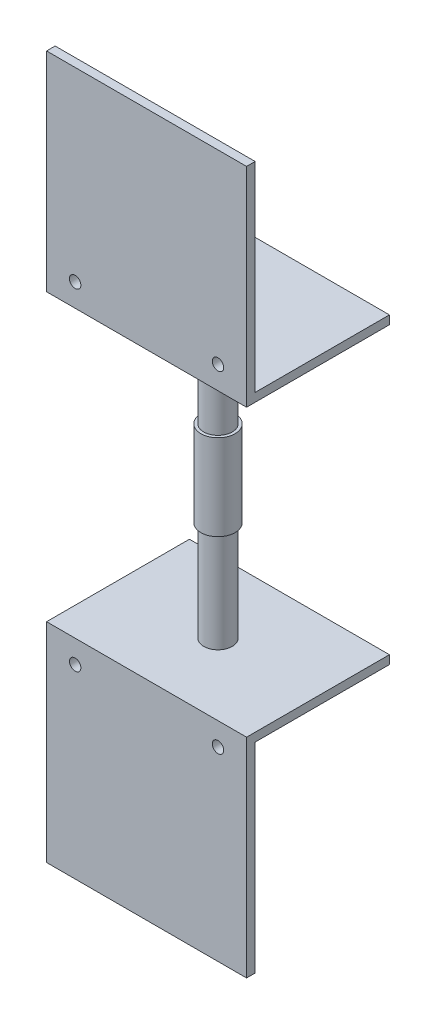
ISO-10303-21;
HEADER;
FILE_DESCRIPTION(('STEP AP214'),'2;1');
FILE_NAME('part.step','',(''),(''),'','','');
FILE_SCHEMA(('AUTOMOTIVE_DESIGN { 1 0 10303 214 1 1 1 1 }'));
ENDSEC;
DATA;
#1=APPLICATION_CONTEXT('core data for automotive mechanical design processes');
#2=APPLICATION_PROTOCOL_DEFINITION('international standard','automotive_design',2000,#1);
#3=PRODUCT_CONTEXT('',#1,'mechanical');
#4=PRODUCT('Part','Part','',(#3));
#5=PRODUCT_RELATED_PRODUCT_CATEGORY('part','',(#4));
#6=PRODUCT_DEFINITION_FORMATION('','',#4);
#7=PRODUCT_DEFINITION_CONTEXT('part definition',#1,'design');
#8=PRODUCT_DEFINITION('design','',#6,#7);
#9=PRODUCT_DEFINITION_SHAPE('','',#8);
#10=(LENGTH_UNIT() NAMED_UNIT(*) SI_UNIT(.MILLI.,.METRE.));
#11=(NAMED_UNIT(*) PLANE_ANGLE_UNIT() SI_UNIT($,.RADIAN.));
#12=(NAMED_UNIT(*) SI_UNIT($,.STERADIAN.) SOLID_ANGLE_UNIT());
#13=UNCERTAINTY_MEASURE_WITH_UNIT(LENGTH_MEASURE(1.E-05),#10,'distance_accuracy_value','');
#14=(GEOMETRIC_REPRESENTATION_CONTEXT(3) GLOBAL_UNCERTAINTY_ASSIGNED_CONTEXT((#13)) GLOBAL_UNIT_ASSIGNED_CONTEXT((#10,
#11,#12)) REPRESENTATION_CONTEXT('',''));
#15=CARTESIAN_POINT('',(0.,0.,0.));
#16=DIRECTION('',(0.,0.,1.));
#17=DIRECTION('',(1.,0.,0.));
#18=AXIS2_PLACEMENT_3D('',#15,#16,#17);
#19=CARTESIAN_POINT('',(0.,-103.,0.));
#20=DIRECTION('',(0.,1.,0.));
#21=DIRECTION('',(0.,0.,1.));
#22=AXIS2_PLACEMENT_3D('',#19,#20,#21);
#23=PLANE('',#22);
#24=DIRECTION('',(1.,0.,0.));
#25=VECTOR('',#24,1.);
#26=CARTESIAN_POINT('',(-35.,-103.,22.));
#27=LINE('',#26,#25);
#28=CARTESIAN_POINT('',(-35.,-103.,22.));
#29=VERTEX_POINT('',#28);
#30=CARTESIAN_POINT('',(35.,-103.,22.));
#31=VERTEX_POINT('',#30);
#32=EDGE_CURVE('E55',#29,#31,#27,.T.);
#33=ORIENTED_EDGE('',*,*,#32,.F.);
#34=DIRECTION('',(0.,0.,-1.));
#35=VECTOR('',#34,1.);
#36=CARTESIAN_POINT('',(-35.,-103.,-25.));
#37=LINE('',#36,#35);
#38=CARTESIAN_POINT('',(-35.,-103.,-25.));
#39=VERTEX_POINT('',#38);
#40=EDGE_CURVE('E154',#29,#39,#37,.T.);
#41=ORIENTED_EDGE('',*,*,#40,.T.);
#42=DIRECTION('',(1.,0.,0.));
#43=VECTOR('',#42,1.);
#44=CARTESIAN_POINT('',(-35.,-103.,-25.));
#45=LINE('',#44,#43);
#46=CARTESIAN_POINT('',(35.,-103.,-25.));
#47=VERTEX_POINT('',#46);
#48=EDGE_CURVE('E172',#39,#47,#45,.T.);
#49=ORIENTED_EDGE('',*,*,#48,.T.);
#50=DIRECTION('',(0.,0.,1.));
#51=VECTOR('',#50,1.);
#52=CARTESIAN_POINT('',(35.,-103.,-25.));
#53=LINE('',#52,#51);
#54=EDGE_CURVE('E166',#47,#31,#53,.T.);
#55=ORIENTED_EDGE('',*,*,#54,.T.);
#56=EDGE_LOOP('',(#33,#41,#49,#55));
#57=FACE_BOUND('',#56,.T.);
#58=ADVANCED_FACE('F39',(#57),#23,.F.);
#59=CARTESIAN_POINT('',(-35.,3.,25.));
#60=DIRECTION('',(1.,0.,0.));
#61=DIRECTION('',(0.,0.,-1.));
#62=AXIS2_PLACEMENT_3D('',#59,#60,#61);
#63=PLANE('',#62);
#64=DIRECTION('',(0.,0.,1.));
#65=VECTOR('',#64,1.);
#66=CARTESIAN_POINT('',(-35.,0.,25.));
#67=LINE('',#66,#65);
#68=CARTESIAN_POINT('',(-35.,0.,-25.));
#69=VERTEX_POINT('',#68);
#70=CARTESIAN_POINT('',(-35.,0.,25.));
#71=VERTEX_POINT('',#70);
#72=EDGE_CURVE('E257',#69,#71,#67,.T.);
#73=ORIENTED_EDGE('',*,*,#72,.T.);
#74=DIRECTION('',(0.,-1.,0.));
#75=VECTOR('',#74,1.);
#76=CARTESIAN_POINT('',(-35.,3.,25.));
#77=LINE('',#76,#75);
#78=CARTESIAN_POINT('',(-35.,73.,25.));
#79=VERTEX_POINT('',#78);
#80=EDGE_CURVE('E48',#79,#71,#77,.T.);
#81=ORIENTED_EDGE('',*,*,#80,.F.);
#82=DIRECTION('',(0.,0.,1.));
#83=VECTOR('',#82,1.);
#84=CARTESIAN_POINT('',(-35.,73.,25.));
#85=LINE('',#84,#83);
#86=CARTESIAN_POINT('',(-35.,73.,22.));
#87=VERTEX_POINT('',#86);
#88=EDGE_CURVE('E233',#87,#79,#85,.T.);
#89=ORIENTED_EDGE('',*,*,#88,.F.);
#90=DIRECTION('',(0.,-1.,0.));
#91=VECTOR('',#90,1.);
#92=CARTESIAN_POINT('',(-35.,73.,22.));
#93=LINE('',#92,#91);
#94=CARTESIAN_POINT('',(-35.,3.,22.));
#95=VERTEX_POINT('',#94);
#96=EDGE_CURVE('E247',#87,#95,#93,.T.);
#97=ORIENTED_EDGE('',*,*,#96,.T.);
#98=DIRECTION('',(0.,0.,1.));
#99=VECTOR('',#98,1.);
#100=CARTESIAN_POINT('',(-35.,3.,25.));
#101=LINE('',#100,#99);
#102=CARTESIAN_POINT('',(-35.,3.,-25.));
#103=VERTEX_POINT('',#102);
#104=EDGE_CURVE('E258',#103,#95,#101,.T.);
#105=ORIENTED_EDGE('',*,*,#104,.F.);
#106=DIRECTION('',(0.,-1.,0.));
#107=VECTOR('',#106,1.);
#108=CARTESIAN_POINT('',(-35.,3.,-25.));
#109=LINE('',#108,#107);
#110=EDGE_CURVE('E268',#103,#69,#109,.T.);
#111=ORIENTED_EDGE('',*,*,#110,.T.);
#112=EDGE_LOOP('',(#73,#81,#89,#97,#105,#111));
#113=FACE_BOUND('',#112,.T.);
#114=ADVANCED_FACE('F41',(#113),#63,.F.);
#115=CARTESIAN_POINT('',(35.,3.,25.));
#116=DIRECTION('',(0.,0.,-1.));
#117=DIRECTION('',(-1.,0.,0.));
#118=AXIS2_PLACEMENT_3D('',#115,#116,#117);
#119=PLANE('',#118);
#120=CARTESIAN_POINT('',(25.,8.,25.));
#121=DIRECTION('',(0.,0.,-1.));
#122=DIRECTION('',(-1.,0.,0.));
#123=AXIS2_PLACEMENT_3D('',#120,#121,#122);
#124=CIRCLE('',#123,2.);
#125=CARTESIAN_POINT('',(23.,8.,25.));
#126=VERTEX_POINT('',#125);
#127=EDGE_CURVE('E221',#126,#126,#124,.T.);
#128=ORIENTED_EDGE('',*,*,#127,.T.);
#129=EDGE_LOOP('',(#128));
#130=FACE_BOUND('',#129,.T.);
#131=CARTESIAN_POINT('',(-25.,8.,25.));
#132=DIRECTION('',(0.,0.,-1.));
#133=DIRECTION('',(-1.,0.,0.));
#134=AXIS2_PLACEMENT_3D('',#131,#132,#133);
#135=CIRCLE('',#134,2.);
#136=CARTESIAN_POINT('',(-27.,8.,25.));
#137=VERTEX_POINT('',#136);
#138=EDGE_CURVE('E229',#137,#137,#135,.T.);
#139=ORIENTED_EDGE('',*,*,#138,.T.);
#140=EDGE_LOOP('',(#139));
#141=FACE_BOUND('',#140,.T.);
#142=DIRECTION('',(1.,0.,0.));
#143=VECTOR('',#142,1.);
#144=CARTESIAN_POINT('',(35.,0.,25.));
#145=LINE('',#144,#143);
#146=CARTESIAN_POINT('',(35.,0.,25.));
#147=VERTEX_POINT('',#146);
#148=EDGE_CURVE('E272',#71,#147,#145,.T.);
#149=ORIENTED_EDGE('',*,*,#148,.T.);
#150=DIRECTION('',(0.,-1.,0.));
#151=VECTOR('',#150,1.);
#152=CARTESIAN_POINT('',(35.,3.,25.));
#153=LINE('',#152,#151);
#154=CARTESIAN_POINT('',(35.,73.,25.));
#155=VERTEX_POINT('',#154);
#156=EDGE_CURVE('E287',#155,#147,#153,.T.);
#157=ORIENTED_EDGE('',*,*,#156,.F.);
#158=DIRECTION('',(1.,0.,0.));
#159=VECTOR('',#158,1.);
#160=CARTESIAN_POINT('',(-35.,73.,25.));
#161=LINE('',#160,#159);
#162=EDGE_CURVE('E237',#79,#155,#161,.T.);
#163=ORIENTED_EDGE('',*,*,#162,.F.);
#164=ORIENTED_EDGE('',*,*,#80,.T.);
#165=EDGE_LOOP('',(#149,#157,#163,#164));
#166=FACE_BOUND('',#165,.T.);
#167=ADVANCED_FACE('F294',(#130,#141,#166),#119,.F.);
#168=CARTESIAN_POINT('',(35.,3.,25.));
#169=DIRECTION('',(-1.,0.,0.));
#170=DIRECTION('',(0.,0.,1.));
#171=AXIS2_PLACEMENT_3D('',#168,#169,#170);
#172=PLANE('',#171);
#173=DIRECTION('',(0.,0.,-1.));
#174=VECTOR('',#173,1.);
#175=CARTESIAN_POINT('',(35.,0.,25.));
#176=LINE('',#175,#174);
#177=CARTESIAN_POINT('',(35.,0.,-25.));
#178=VERTEX_POINT('',#177);
#179=EDGE_CURVE('E275',#147,#178,#176,.T.);
#180=ORIENTED_EDGE('',*,*,#179,.T.);
#181=DIRECTION('',(0.,-1.,0.));
#182=VECTOR('',#181,1.);
#183=CARTESIAN_POINT('',(35.,3.,-25.));
#184=LINE('',#183,#182);
#185=CARTESIAN_POINT('',(35.,3.,-25.));
#186=VERTEX_POINT('',#185);
#187=EDGE_CURVE('E283',#186,#178,#184,.T.);
#188=ORIENTED_EDGE('',*,*,#187,.F.);
#189=DIRECTION('',(0.,0.,-1.));
#190=VECTOR('',#189,1.);
#191=CARTESIAN_POINT('',(35.,3.,25.));
#192=LINE('',#191,#190);
#193=CARTESIAN_POINT('',(35.,3.,22.));
#194=VERTEX_POINT('',#193);
#195=EDGE_CURVE('E261',#194,#186,#192,.T.);
#196=ORIENTED_EDGE('',*,*,#195,.F.);
#197=DIRECTION('',(0.,-1.,0.));
#198=VECTOR('',#197,1.);
#199=CARTESIAN_POINT('',(35.,73.,22.));
#200=LINE('',#199,#198);
#201=CARTESIAN_POINT('',(35.,73.,22.));
#202=VERTEX_POINT('',#201);
#203=EDGE_CURVE('E253',#202,#194,#200,.T.);
#204=ORIENTED_EDGE('',*,*,#203,.F.);
#205=DIRECTION('',(0.,0.,-1.));
#206=VECTOR('',#205,1.);
#207=CARTESIAN_POINT('',(35.,73.,25.));
#208=LINE('',#207,#206);
#209=EDGE_CURVE('E241',#155,#202,#208,.T.);
#210=ORIENTED_EDGE('',*,*,#209,.F.);
#211=ORIENTED_EDGE('',*,*,#156,.T.);
#212=EDGE_LOOP('',(#180,#188,#196,#204,#210,#211));
#213=FACE_BOUND('',#212,.T.);
#214=ADVANCED_FACE('F306',(#213),#172,.F.);
#215=CARTESIAN_POINT('',(35.,3.,-25.));
#216=DIRECTION('',(0.,0.,1.));
#217=DIRECTION('',(1.,0.,0.));
#218=AXIS2_PLACEMENT_3D('',#215,#216,#217);
#219=PLANE('',#218);
#220=DIRECTION('',(-1.,0.,0.));
#221=VECTOR('',#220,1.);
#222=CARTESIAN_POINT('',(35.,0.,-25.));
#223=LINE('',#222,#221);
#224=EDGE_CURVE('E262',#178,#69,#223,.T.);
#225=ORIENTED_EDGE('',*,*,#224,.T.);
#226=ORIENTED_EDGE('',*,*,#110,.F.);
#227=DIRECTION('',(-1.,0.,0.));
#228=VECTOR('',#227,1.);
#229=CARTESIAN_POINT('',(35.,3.,-25.));
#230=LINE('',#229,#228);
#231=EDGE_CURVE('E265',#186,#103,#230,.T.);
#232=ORIENTED_EDGE('',*,*,#231,.F.);
#233=ORIENTED_EDGE('',*,*,#187,.T.);
#234=EDGE_LOOP('',(#225,#226,#232,#233));
#235=FACE_BOUND('',#234,.T.);
#236=ADVANCED_FACE('F310',(#235),#219,.F.);
#237=CARTESIAN_POINT('',(0.,3.,0.));
#238=DIRECTION('',(0.,1.,0.));
#239=DIRECTION('',(0.,0.,1.));
#240=AXIS2_PLACEMENT_3D('',#237,#238,#239);
#241=PLANE('',#240);
#242=DIRECTION('',(-1.,0.,0.));
#243=VECTOR('',#242,1.);
#244=CARTESIAN_POINT('',(-35.,3.,22.));
#245=LINE('',#244,#243);
#246=EDGE_CURVE('E63',#194,#95,#245,.T.);
#247=ORIENTED_EDGE('',*,*,#246,.F.);
#248=ORIENTED_EDGE('',*,*,#195,.T.);
#249=ORIENTED_EDGE('',*,*,#231,.T.);
#250=ORIENTED_EDGE('',*,*,#104,.T.);
#251=EDGE_LOOP('',(#247,#248,#249,#250));
#252=FACE_BOUND('',#251,.T.);
#253=ADVANCED_FACE('F311',(#252),#241,.T.);
#254=CARTESIAN_POINT('',(0.,0.,0.));
#255=DIRECTION('',(0.,1.,0.));
#256=DIRECTION('',(0.,0.,1.));
#257=AXIS2_PLACEMENT_3D('',#254,#255,#256);
#258=PLANE('',#257);
#259=CARTESIAN_POINT('',(0.,0.,0.));
#260=DIRECTION('',(0.,1.,0.));
#261=DIRECTION('',(0.,0.,1.));
#262=AXIS2_PLACEMENT_3D('',#259,#260,#261);
#263=CIRCLE('',#262,5.);
#264=CARTESIAN_POINT('',(0.,0.,5.));
#265=VERTEX_POINT('',#264);
#266=EDGE_CURVE('E11',#265,#265,#263,.F.);
#267=ORIENTED_EDGE('',*,*,#266,.F.);
#268=EDGE_LOOP('',(#267));
#269=FACE_BOUND('',#268,.T.);
#270=ORIENTED_EDGE('',*,*,#72,.F.);
#271=ORIENTED_EDGE('',*,*,#224,.F.);
#272=ORIENTED_EDGE('',*,*,#179,.F.);
#273=ORIENTED_EDGE('',*,*,#148,.F.);
#274=EDGE_LOOP('',(#270,#271,#272,#273));
#275=FACE_BOUND('',#274,.T.);
#276=ADVANCED_FACE('F302',(#269,#275),#258,.F.);
#277=CARTESIAN_POINT('',(-35.,73.,22.));
#278=DIRECTION('',(0.,0.,1.));
#279=DIRECTION('',(1.,0.,0.));
#280=AXIS2_PLACEMENT_3D('',#277,#278,#279);
#281=PLANE('',#280);
#282=CARTESIAN_POINT('',(25.,8.,22.));
#283=DIRECTION('',(0.,0.,-1.));
#284=DIRECTION('',(-1.,0.,0.));
#285=AXIS2_PLACEMENT_3D('',#282,#283,#284);
#286=CIRCLE('',#285,2.);
#287=CARTESIAN_POINT('',(23.,8.,22.));
#288=VERTEX_POINT('',#287);
#289=EDGE_CURVE('E217',#288,#288,#286,.T.);
#290=ORIENTED_EDGE('',*,*,#289,.F.);
#291=EDGE_LOOP('',(#290));
#292=FACE_BOUND('',#291,.T.);
#293=CARTESIAN_POINT('',(-25.,8.,22.));
#294=DIRECTION('',(0.,0.,-1.));
#295=DIRECTION('',(-1.,0.,0.));
#296=AXIS2_PLACEMENT_3D('',#293,#294,#295);
#297=CIRCLE('',#296,2.);
#298=CARTESIAN_POINT('',(-27.,8.,22.));
#299=VERTEX_POINT('',#298);
#300=EDGE_CURVE('E225',#299,#299,#297,.T.);
#301=ORIENTED_EDGE('',*,*,#300,.F.);
#302=EDGE_LOOP('',(#301));
#303=FACE_BOUND('',#302,.T.);
#304=ORIENTED_EDGE('',*,*,#246,.T.);
#305=ORIENTED_EDGE('',*,*,#96,.F.);
#306=DIRECTION('',(-1.,0.,0.));
#307=VECTOR('',#306,1.);
#308=CARTESIAN_POINT('',(-35.,73.,22.));
#309=LINE('',#308,#307);
#310=EDGE_CURVE('E244',#202,#87,#309,.T.);
#311=ORIENTED_EDGE('',*,*,#310,.F.);
#312=ORIENTED_EDGE('',*,*,#203,.T.);
#313=EDGE_LOOP('',(#304,#305,#311,#312));
#314=FACE_BOUND('',#313,.T.);
#315=ADVANCED_FACE('F315',(#292,#303,#314),#281,.F.);
#316=CARTESIAN_POINT('',(0.,73.,0.));
#317=DIRECTION('',(0.,-1.,0.));
#318=DIRECTION('',(0.,0.,-1.));
#319=AXIS2_PLACEMENT_3D('',#316,#317,#318);
#320=PLANE('',#319);
#321=ORIENTED_EDGE('',*,*,#88,.T.);
#322=ORIENTED_EDGE('',*,*,#162,.T.);
#323=ORIENTED_EDGE('',*,*,#209,.T.);
#324=ORIENTED_EDGE('',*,*,#310,.T.);
#325=EDGE_LOOP('',(#321,#322,#323,#324));
#326=FACE_BOUND('',#325,.T.);
#327=ADVANCED_FACE('F318',(#326),#320,.F.);
#328=CARTESIAN_POINT('',(-25.,8.,28.));
#329=DIRECTION('',(0.,0.,-1.));
#330=DIRECTION('',(-1.,0.,0.));
#331=AXIS2_PLACEMENT_3D('',#328,#329,#330);
#332=CYLINDRICAL_SURFACE('',#331,2.);
#333=ORIENTED_EDGE('',*,*,#300,.T.);
#334=EDGE_LOOP('',(#333));
#335=FACE_BOUND('',#334,.T.);
#336=ORIENTED_EDGE('',*,*,#138,.F.);
#337=EDGE_LOOP('',(#336));
#338=FACE_BOUND('',#337,.T.);
#339=ADVANCED_FACE('F320',(#335,#338),#332,.F.);
#340=CARTESIAN_POINT('',(25.,8.,28.));
#341=DIRECTION('',(0.,0.,-1.));
#342=DIRECTION('',(-1.,0.,0.));
#343=AXIS2_PLACEMENT_3D('',#340,#341,#342);
#344=CYLINDRICAL_SURFACE('',#343,2.);
#345=ORIENTED_EDGE('',*,*,#289,.T.);
#346=EDGE_LOOP('',(#345));
#347=FACE_BOUND('',#346,.T.);
#348=ORIENTED_EDGE('',*,*,#127,.F.);
#349=EDGE_LOOP('',(#348));
#350=FACE_BOUND('',#349,.T.);
#351=ADVANCED_FACE('F326',(#347,#350),#344,.F.);
#352=CARTESIAN_POINT('',(0.,-35.,0.));
#353=DIRECTION('',(0.,1.,0.));
#354=DIRECTION('',(0.,0.,1.));
#355=AXIS2_PLACEMENT_3D('',#352,#353,#354);
#356=CYLINDRICAL_SURFACE('',#355,5.);
#357=CARTESIAN_POINT('',(0.,-35.,0.));
#358=DIRECTION('',(0.,-1.,0.));
#359=DIRECTION('',(0.,0.,-1.));
#360=AXIS2_PLACEMENT_3D('',#357,#358,#359);
#361=CIRCLE('',#360,5.);
#362=CARTESIAN_POINT('',(0.,-35.,-5.));
#363=VERTEX_POINT('',#362);
#364=EDGE_CURVE('E210',#363,#363,#361,.T.);
#365=ORIENTED_EDGE('',*,*,#364,.F.);
#366=EDGE_LOOP('',(#365));
#367=FACE_BOUND('',#366,.T.);
#368=ORIENTED_EDGE('',*,*,#266,.T.);
#369=EDGE_LOOP('',(#368));
#370=FACE_BOUND('',#369,.T.);
#371=ADVANCED_FACE('F372',(#367,#370),#356,.T.);
#372=CARTESIAN_POINT('',(0.,-65.,0.));
#373=DIRECTION('',(0.,1.,0.));
#374=DIRECTION('',(0.,0.,1.));
#375=AXIS2_PLACEMENT_3D('',#372,#373,#374);
#376=CYLINDRICAL_SURFACE('',#375,6.);
#377=CARTESIAN_POINT('',(0.,-65.,0.));
#378=DIRECTION('',(0.,-1.,0.));
#379=DIRECTION('',(0.,0.,-1.));
#380=AXIS2_PLACEMENT_3D('',#377,#378,#379);
#381=CIRCLE('',#380,6.);
#382=CARTESIAN_POINT('',(0.,-65.,-6.));
#383=VERTEX_POINT('',#382);
#384=EDGE_CURVE('E206',#383,#383,#381,.T.);
#385=ORIENTED_EDGE('',*,*,#384,.F.);
#386=EDGE_LOOP('',(#385));
#387=FACE_BOUND('',#386,.T.);
#388=CARTESIAN_POINT('',(0.,-35.,0.));
#389=DIRECTION('',(0.,-1.,0.));
#390=DIRECTION('',(0.,0.,-1.));
#391=AXIS2_PLACEMENT_3D('',#388,#389,#390);
#392=CIRCLE('',#391,6.);
#393=CARTESIAN_POINT('',(0.,-35.,-6.));
#394=VERTEX_POINT('',#393);
#395=EDGE_CURVE('E202',#394,#394,#392,.T.);
#396=ORIENTED_EDGE('',*,*,#395,.T.);
#397=EDGE_LOOP('',(#396));
#398=FACE_BOUND('',#397,.T.);
#399=ADVANCED_FACE('F365',(#387,#398),#376,.T.);
#400=CARTESIAN_POINT('',(0.,-65.,0.));
#401=DIRECTION('',(0.,-1.,0.));
#402=DIRECTION('',(0.,0.,-1.));
#403=AXIS2_PLACEMENT_3D('',#400,#401,#402);
#404=PLANE('',#403);
#405=CARTESIAN_POINT('',(0.,-65.,0.));
#406=DIRECTION('',(0.,-1.,0.));
#407=DIRECTION('',(0.,0.,-1.));
#408=AXIS2_PLACEMENT_3D('',#405,#406,#407);
#409=CIRCLE('',#408,5.);
#410=CARTESIAN_POINT('',(0.,-65.,-5.));
#411=VERTEX_POINT('',#410);
#412=EDGE_CURVE('E197',#411,#411,#409,.T.);
#413=ORIENTED_EDGE('',*,*,#412,.F.);
#414=EDGE_LOOP('',(#413));
#415=FACE_BOUND('',#414,.T.);
#416=ORIENTED_EDGE('',*,*,#384,.T.);
#417=EDGE_LOOP('',(#416));
#418=FACE_BOUND('',#417,.T.);
#419=ADVANCED_FACE('F362',(#415,#418),#404,.T.);
#420=CARTESIAN_POINT('',(0.,-35.,0.));
#421=DIRECTION('',(0.,-1.,0.));
#422=DIRECTION('',(0.,0.,-1.));
#423=AXIS2_PLACEMENT_3D('',#420,#421,#422);
#424=PLANE('',#423);
#425=ORIENTED_EDGE('',*,*,#364,.T.);
#426=EDGE_LOOP('',(#425));
#427=FACE_BOUND('',#426,.T.);
#428=ORIENTED_EDGE('',*,*,#395,.F.);
#429=EDGE_LOOP('',(#428));
#430=FACE_BOUND('',#429,.T.);
#431=ADVANCED_FACE('F360',(#427,#430),#424,.F.);
#432=CARTESIAN_POINT('',(0.,-100.,0.));
#433=DIRECTION('',(0.,1.,0.));
#434=DIRECTION('',(0.,0.,1.));
#435=AXIS2_PLACEMENT_3D('',#432,#433,#434);
#436=CYLINDRICAL_SURFACE('',#435,5.);
#437=CARTESIAN_POINT('',(0.,-100.,0.));
#438=DIRECTION('',(0.,-1.,0.));
#439=DIRECTION('',(0.,0.,-1.));
#440=AXIS2_PLACEMENT_3D('',#437,#438,#439);
#441=CIRCLE('',#440,5.);
#442=CARTESIAN_POINT('',(0.,-100.,-5.));
#443=VERTEX_POINT('',#442);
#444=EDGE_CURVE('E198',#443,#443,#441,.T.);
#445=ORIENTED_EDGE('',*,*,#444,.F.);
#446=EDGE_LOOP('',(#445));
#447=FACE_BOUND('',#446,.T.);
#448=ORIENTED_EDGE('',*,*,#412,.T.);
#449=EDGE_LOOP('',(#448));
#450=FACE_BOUND('',#449,.T.);
#451=ADVANCED_FACE('F356',(#447,#450),#436,.T.);
#452=CARTESIAN_POINT('',(35.,-103.,-25.));
#453=DIRECTION('',(-1.,0.,0.));
#454=DIRECTION('',(0.,0.,1.));
#455=AXIS2_PLACEMENT_3D('',#452,#453,#454);
#456=PLANE('',#455);
#457=DIRECTION('',(0.,0.,1.));
#458=VECTOR('',#457,1.);
#459=CARTESIAN_POINT('',(35.,-100.,-25.));
#460=LINE('',#459,#458);
#461=CARTESIAN_POINT('',(35.,-100.,-25.));
#462=VERTEX_POINT('',#461);
#463=CARTESIAN_POINT('',(35.,-100.,25.));
#464=VERTEX_POINT('',#463);
#465=EDGE_CURVE('E156',#462,#464,#460,.T.);
#466=ORIENTED_EDGE('',*,*,#465,.T.);
#467=DIRECTION('',(0.,1.,0.));
#468=VECTOR('',#467,1.);
#469=CARTESIAN_POINT('',(35.,-103.,25.));
#470=LINE('',#469,#468);
#471=CARTESIAN_POINT('',(35.,-173.,25.));
#472=VERTEX_POINT('',#471);
#473=EDGE_CURVE('E193',#472,#464,#470,.T.);
#474=ORIENTED_EDGE('',*,*,#473,.F.);
#475=DIRECTION('',(0.,0.,1.));
#476=VECTOR('',#475,1.);
#477=CARTESIAN_POINT('',(35.,-173.,25.));
#478=LINE('',#477,#476);
#479=CARTESIAN_POINT('',(35.,-173.,22.));
#480=VERTEX_POINT('',#479);
#481=EDGE_CURVE('E140',#480,#472,#478,.T.);
#482=ORIENTED_EDGE('',*,*,#481,.F.);
#483=DIRECTION('',(0.,1.,0.));
#484=VECTOR('',#483,1.);
#485=CARTESIAN_POINT('',(35.,-173.,22.));
#486=LINE('',#485,#484);
#487=EDGE_CURVE('E135',#480,#31,#486,.T.);
#488=ORIENTED_EDGE('',*,*,#487,.T.);
#489=ORIENTED_EDGE('',*,*,#54,.F.);
#490=DIRECTION('',(0.,1.,0.));
#491=VECTOR('',#490,1.);
#492=CARTESIAN_POINT('',(35.,-103.,-25.));
#493=LINE('',#492,#491);
#494=EDGE_CURVE('E174',#47,#462,#493,.T.);
#495=ORIENTED_EDGE('',*,*,#494,.T.);
#496=EDGE_LOOP('',(#466,#474,#482,#488,#489,#495));
#497=FACE_BOUND('',#496,.T.);
#498=ADVANCED_FACE('F352',(#497),#456,.F.);
#499=CARTESIAN_POINT('',(-35.,-103.,25.));
#500=DIRECTION('',(0.,0.,-1.));
#501=DIRECTION('',(-1.,0.,0.));
#502=AXIS2_PLACEMENT_3D('',#499,#500,#501);
#503=PLANE('',#502);
#504=CARTESIAN_POINT('',(-25.,-108.,25.));
#505=DIRECTION('',(0.,0.,-1.));
#506=DIRECTION('',(-1.,0.,0.));
#507=AXIS2_PLACEMENT_3D('',#504,#505,#506);
#508=CIRCLE('',#507,2.);
#509=CARTESIAN_POINT('',(-27.,-108.,25.));
#510=VERTEX_POINT('',#509);
#511=EDGE_CURVE('E538',#510,#510,#508,.T.);
#512=ORIENTED_EDGE('',*,*,#511,.T.);
#513=EDGE_LOOP('',(#512));
#514=FACE_BOUND('',#513,.T.);
#515=CARTESIAN_POINT('',(25.,-108.,25.));
#516=DIRECTION('',(0.,0.,-1.));
#517=DIRECTION('',(-1.,0.,0.));
#518=AXIS2_PLACEMENT_3D('',#515,#516,#517);
#519=CIRCLE('',#518,2.);
#520=CARTESIAN_POINT('',(23.,-108.,25.));
#521=VERTEX_POINT('',#520);
#522=EDGE_CURVE('E545',#521,#521,#519,.T.);
#523=ORIENTED_EDGE('',*,*,#522,.T.);
#524=EDGE_LOOP('',(#523));
#525=FACE_BOUND('',#524,.T.);
#526=DIRECTION('',(-1.,0.,0.));
#527=VECTOR('',#526,1.);
#528=CARTESIAN_POINT('',(-35.,-100.,25.));
#529=LINE('',#528,#527);
#530=CARTESIAN_POINT('',(-35.,-100.,25.));
#531=VERTEX_POINT('',#530);
#532=EDGE_CURVE('E161',#464,#531,#529,.T.);
#533=ORIENTED_EDGE('',*,*,#532,.T.);
#534=DIRECTION('',(0.,1.,0.));
#535=VECTOR('',#534,1.);
#536=CARTESIAN_POINT('',(-35.,-103.,25.));
#537=LINE('',#536,#535);
#538=CARTESIAN_POINT('',(-35.,-173.,25.));
#539=VERTEX_POINT('',#538);
#540=EDGE_CURVE('E190',#539,#531,#537,.T.);
#541=ORIENTED_EDGE('',*,*,#540,.F.);
#542=DIRECTION('',(-1.,0.,0.));
#543=VECTOR('',#542,1.);
#544=CARTESIAN_POINT('',(-35.,-173.,25.));
#545=LINE('',#544,#543);
#546=EDGE_CURVE('E147',#472,#539,#545,.T.);
#547=ORIENTED_EDGE('',*,*,#546,.F.);
#548=ORIENTED_EDGE('',*,*,#473,.T.);
#549=EDGE_LOOP('',(#533,#541,#547,#548));
#550=FACE_BOUND('',#549,.T.);
#551=ADVANCED_FACE('F349',(#514,#525,#550),#503,.F.);
#552=CARTESIAN_POINT('',(-35.,-103.,-25.));
#553=DIRECTION('',(1.,0.,0.));
#554=DIRECTION('',(0.,0.,-1.));
#555=AXIS2_PLACEMENT_3D('',#552,#553,#554);
#556=PLANE('',#555);
#557=DIRECTION('',(0.,0.,-1.));
#558=VECTOR('',#557,1.);
#559=CARTESIAN_POINT('',(-35.,-100.,-25.));
#560=LINE('',#559,#558);
#561=CARTESIAN_POINT('',(-35.,-100.,-25.));
#562=VERTEX_POINT('',#561);
#563=EDGE_CURVE('E178',#531,#562,#560,.T.);
#564=ORIENTED_EDGE('',*,*,#563,.T.);
#565=DIRECTION('',(0.,1.,0.));
#566=VECTOR('',#565,1.);
#567=CARTESIAN_POINT('',(-35.,-103.,-25.));
#568=LINE('',#567,#566);
#569=EDGE_CURVE('E186',#39,#562,#568,.T.);
#570=ORIENTED_EDGE('',*,*,#569,.F.);
#571=ORIENTED_EDGE('',*,*,#40,.F.);
#572=DIRECTION('',(0.,1.,0.));
#573=VECTOR('',#572,1.);
#574=CARTESIAN_POINT('',(-35.,-173.,22.));
#575=LINE('',#574,#573);
#576=CARTESIAN_POINT('',(-35.,-173.,22.));
#577=VERTEX_POINT('',#576);
#578=EDGE_CURVE('E133',#577,#29,#575,.T.);
#579=ORIENTED_EDGE('',*,*,#578,.F.);
#580=DIRECTION('',(0.,0.,-1.));
#581=VECTOR('',#580,1.);
#582=CARTESIAN_POINT('',(-35.,-173.,25.));
#583=LINE('',#582,#581);
#584=EDGE_CURVE('E141',#539,#577,#583,.T.);
#585=ORIENTED_EDGE('',*,*,#584,.F.);
#586=ORIENTED_EDGE('',*,*,#540,.T.);
#587=EDGE_LOOP('',(#564,#570,#571,#579,#585,#586));
#588=FACE_BOUND('',#587,.T.);
#589=ADVANCED_FACE('F152',(#588),#556,.F.);
#590=CARTESIAN_POINT('',(-35.,-103.,-25.));
#591=DIRECTION('',(0.,0.,1.));
#592=DIRECTION('',(1.,0.,0.));
#593=AXIS2_PLACEMENT_3D('',#590,#591,#592);
#594=PLANE('',#593);
#595=DIRECTION('',(1.,0.,0.));
#596=VECTOR('',#595,1.);
#597=CARTESIAN_POINT('',(-35.,-100.,-25.));
#598=LINE('',#597,#596);
#599=EDGE_CURVE('E169',#562,#462,#598,.T.);
#600=ORIENTED_EDGE('',*,*,#599,.T.);
#601=ORIENTED_EDGE('',*,*,#494,.F.);
#602=ORIENTED_EDGE('',*,*,#48,.F.);
#603=ORIENTED_EDGE('',*,*,#569,.T.);
#604=EDGE_LOOP('',(#600,#601,#602,#603));
#605=FACE_BOUND('',#604,.T.);
#606=ADVANCED_FACE('F342',(#605),#594,.F.);
#607=CARTESIAN_POINT('',(0.,-100.,0.));
#608=DIRECTION('',(0.,1.,0.));
#609=DIRECTION('',(0.,0.,1.));
#610=AXIS2_PLACEMENT_3D('',#607,#608,#609);
#611=PLANE('',#610);
#612=ORIENTED_EDGE('',*,*,#444,.T.);
#613=EDGE_LOOP('',(#612));
#614=FACE_BOUND('',#613,.T.);
#615=ORIENTED_EDGE('',*,*,#465,.F.);
#616=ORIENTED_EDGE('',*,*,#599,.F.);
#617=ORIENTED_EDGE('',*,*,#563,.F.);
#618=ORIENTED_EDGE('',*,*,#532,.F.);
#619=EDGE_LOOP('',(#615,#616,#617,#618));
#620=FACE_BOUND('',#619,.T.);
#621=ADVANCED_FACE('F339',(#614,#620),#611,.T.);
#622=CARTESIAN_POINT('',(-35.,-173.,22.));
#623=DIRECTION('',(0.,0.,1.));
#624=DIRECTION('',(1.,0.,0.));
#625=AXIS2_PLACEMENT_3D('',#622,#623,#624);
#626=PLANE('',#625);
#627=CARTESIAN_POINT('',(-25.,-108.,22.));
#628=DIRECTION('',(0.,0.,-1.));
#629=DIRECTION('',(-1.,0.,0.));
#630=AXIS2_PLACEMENT_3D('',#627,#628,#629);
#631=CIRCLE('',#630,2.);
#632=CARTESIAN_POINT('',(-27.,-108.,22.));
#633=VERTEX_POINT('',#632);
#634=EDGE_CURVE('E535',#633,#633,#631,.T.);
#635=ORIENTED_EDGE('',*,*,#634,.F.);
#636=EDGE_LOOP('',(#635));
#637=FACE_BOUND('',#636,.T.);
#638=CARTESIAN_POINT('',(25.,-108.,22.));
#639=DIRECTION('',(0.,0.,-1.));
#640=DIRECTION('',(-1.,0.,0.));
#641=AXIS2_PLACEMENT_3D('',#638,#639,#640);
#642=CIRCLE('',#641,2.);
#643=CARTESIAN_POINT('',(23.,-108.,22.));
#644=VERTEX_POINT('',#643);
#645=EDGE_CURVE('E540',#644,#644,#642,.T.);
#646=ORIENTED_EDGE('',*,*,#645,.F.);
#647=EDGE_LOOP('',(#646));
#648=FACE_BOUND('',#647,.T.);
#649=ORIENTED_EDGE('',*,*,#32,.T.);
#650=ORIENTED_EDGE('',*,*,#487,.F.);
#651=DIRECTION('',(1.,0.,0.));
#652=VECTOR('',#651,1.);
#653=CARTESIAN_POINT('',(-35.,-173.,22.));
#654=LINE('',#653,#652);
#655=EDGE_CURVE('E129',#577,#480,#654,.T.);
#656=ORIENTED_EDGE('',*,*,#655,.F.);
#657=ORIENTED_EDGE('',*,*,#578,.T.);
#658=EDGE_LOOP('',(#649,#650,#656,#657));
#659=FACE_BOUND('',#658,.T.);
#660=ADVANCED_FACE('F131',(#637,#648,#659),#626,.F.);
#661=CARTESIAN_POINT('',(0.,-173.,0.));
#662=DIRECTION('',(0.,-1.,0.));
#663=DIRECTION('',(0.,0.,-1.));
#664=AXIS2_PLACEMENT_3D('',#661,#662,#663);
#665=PLANE('',#664);
#666=ORIENTED_EDGE('',*,*,#584,.T.);
#667=ORIENTED_EDGE('',*,*,#655,.T.);
#668=ORIENTED_EDGE('',*,*,#481,.T.);
#669=ORIENTED_EDGE('',*,*,#546,.T.);
#670=EDGE_LOOP('',(#666,#667,#668,#669));
#671=FACE_BOUND('',#670,.T.);
#672=ADVANCED_FACE('F145',(#671),#665,.T.);
#673=CARTESIAN_POINT('',(25.,-108.,92.));
#674=DIRECTION('',(0.,0.,-1.));
#675=DIRECTION('',(-1.,0.,0.));
#676=AXIS2_PLACEMENT_3D('',#673,#674,#675);
#677=CYLINDRICAL_SURFACE('',#676,2.);
#678=ORIENTED_EDGE('',*,*,#645,.T.);
#679=EDGE_LOOP('',(#678));
#680=FACE_BOUND('',#679,.T.);
#681=ORIENTED_EDGE('',*,*,#522,.F.);
#682=EDGE_LOOP('',(#681));
#683=FACE_BOUND('',#682,.T.);
#684=ADVANCED_FACE('F500',(#680,#683),#677,.F.);
#685=CARTESIAN_POINT('',(-25.,-108.,92.));
#686=DIRECTION('',(0.,0.,-1.));
#687=DIRECTION('',(-1.,0.,0.));
#688=AXIS2_PLACEMENT_3D('',#685,#686,#687);
#689=CYLINDRICAL_SURFACE('',#688,2.);
#690=ORIENTED_EDGE('',*,*,#634,.T.);
#691=EDGE_LOOP('',(#690));
#692=FACE_BOUND('',#691,.T.);
#693=ORIENTED_EDGE('',*,*,#511,.F.);
#694=EDGE_LOOP('',(#693));
#695=FACE_BOUND('',#694,.T.);
#696=ADVANCED_FACE('F518',(#692,#695),#689,.F.);
#697=CLOSED_SHELL('',(#58,#114,#167,#214,#236,#253,#276,#315,#327,#339,#351,#371,#399,#419,#431,
#451,#498,#551,#589,#606,#621,#660,#672,#684,#696));
#698=MANIFOLD_SOLID_BREP('B2',#697);
#699=ADVANCED_BREP_SHAPE_REPRESENTATION('',(#18,#698),#14);
#700=SHAPE_DEFINITION_REPRESENTATION(#9,#699);
ENDSEC;
END-ISO-10303-21;
